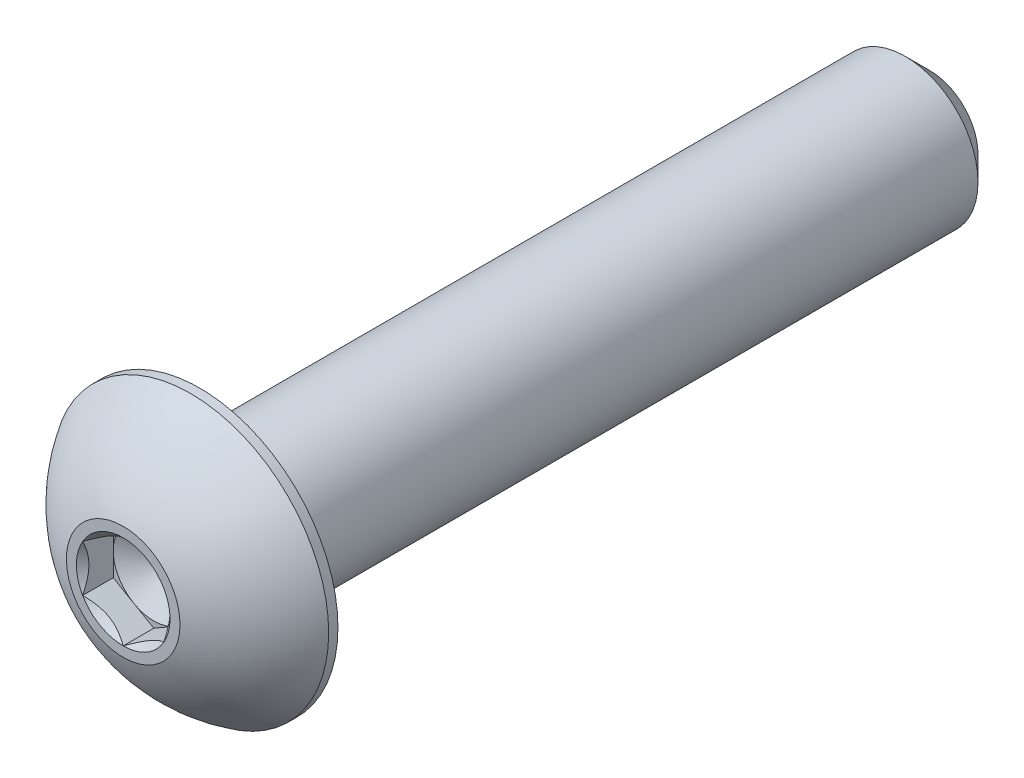
ISO-10303-21;
HEADER;
FILE_DESCRIPTION(('STEP AP214'),'2;1');
FILE_NAME('part.step','',(''),(''),'','','');
FILE_SCHEMA(('AUTOMOTIVE_DESIGN { 1 0 10303 214 1 1 1 1 }'));
ENDSEC;
DATA;
#1=APPLICATION_CONTEXT('core data for automotive mechanical design processes');
#2=APPLICATION_PROTOCOL_DEFINITION('international standard','automotive_design',2000,#1);
#3=PRODUCT_CONTEXT('',#1,'mechanical');
#4=PRODUCT('Part','Part','',(#3));
#5=PRODUCT_RELATED_PRODUCT_CATEGORY('part','',(#4));
#6=PRODUCT_DEFINITION_FORMATION('','',#4);
#7=PRODUCT_DEFINITION_CONTEXT('part definition',#1,'design');
#8=PRODUCT_DEFINITION('design','',#6,#7);
#9=PRODUCT_DEFINITION_SHAPE('','',#8);
#10=(LENGTH_UNIT() NAMED_UNIT(*) SI_UNIT(.MILLI.,.METRE.));
#11=(NAMED_UNIT(*) PLANE_ANGLE_UNIT() SI_UNIT($,.RADIAN.));
#12=(NAMED_UNIT(*) SI_UNIT($,.STERADIAN.) SOLID_ANGLE_UNIT());
#13=UNCERTAINTY_MEASURE_WITH_UNIT(LENGTH_MEASURE(1.E-05),#10,'distance_accuracy_value','');
#14=(GEOMETRIC_REPRESENTATION_CONTEXT(3) GLOBAL_UNCERTAINTY_ASSIGNED_CONTEXT((#13)) GLOBAL_UNIT_ASSIGNED_CONTEXT((#10,
#11,#12)) REPRESENTATION_CONTEXT('',''));
#15=CARTESIAN_POINT('',(0.,0.,0.));
#16=DIRECTION('',(0.,0.,1.));
#17=DIRECTION('',(1.,0.,0.));
#18=AXIS2_PLACEMENT_3D('',#15,#16,#17);
#19=CARTESIAN_POINT('',(0.,0.,7.89305));
#20=DIRECTION('',(0.,0.,1.));
#21=DIRECTION('',(1.,0.,0.));
#22=AXIS2_PLACEMENT_3D('',#19,#20,#21);
#23=CYLINDRICAL_SURFACE('',#22,1.4224);
#24=CARTESIAN_POINT('',(0.,0.,-7.4168));
#25=DIRECTION('',(0.,0.,1.));
#26=DIRECTION('',(1.,0.,0.));
#27=AXIS2_PLACEMENT_3D('',#24,#25,#26);
#28=CIRCLE('',#27,1.4224);
#29=CARTESIAN_POINT('',(1.4224,0.,-7.4168));
#30=VERTEX_POINT('',#29);
#31=EDGE_CURVE('E48',#30,#30,#28,.T.);
#32=ORIENTED_EDGE('',*,*,#31,.T.);
#33=EDGE_LOOP('',(#32));
#34=FACE_BOUND('',#33,.T.);
#35=CARTESIAN_POINT('',(0.,0.,6.38213165465657));
#36=DIRECTION('',(0.,0.,1.));
#37=DIRECTION('',(1.,0.,0.));
#38=AXIS2_PLACEMENT_3D('',#35,#36,#37);
#39=CIRCLE('',#38,1.4224);
#40=CARTESIAN_POINT('',(1.4224,0.,6.38213165465657));
#41=VERTEX_POINT('',#40);
#42=EDGE_CURVE('E12',#41,#41,#39,.T.);
#43=ORIENTED_EDGE('',*,*,#42,.F.);
#44=EDGE_LOOP('',(#43));
#45=FACE_BOUND('',#44,.T.);
#46=ADVANCED_FACE('F40',(#34,#45),#23,.T.);
#47=CARTESIAN_POINT('',(0.,0.,-7.89305));
#48=DIRECTION('',(0.,0.,1.));
#49=DIRECTION('',(1.,0.,0.));
#50=AXIS2_PLACEMENT_3D('',#47,#48,#49);
#51=CONICAL_SURFACE('',#50,0.946150000000002,0.785398163397447);
#52=ORIENTED_EDGE('',*,*,#31,.F.);
#53=EDGE_LOOP('',(#52));
#54=FACE_BOUND('',#53,.T.);
#55=CARTESIAN_POINT('',(0.,0.,-7.89305));
#56=DIRECTION('',(0.,0.,1.));
#57=DIRECTION('',(1.,0.,0.));
#58=AXIS2_PLACEMENT_3D('',#55,#56,#57);
#59=CIRCLE('',#58,0.946150000000002);
#60=CARTESIAN_POINT('',(0.946150000000002,0.,-7.89305));
#61=VERTEX_POINT('',#60);
#62=EDGE_CURVE('E263',#61,#61,#59,.T.);
#63=ORIENTED_EDGE('',*,*,#62,.T.);
#64=EDGE_LOOP('',(#63));
#65=FACE_BOUND('',#64,.T.);
#66=ADVANCED_FACE('F42',(#54,#65),#51,.T.);
#67=CARTESIAN_POINT('',(0.,0.946150000000002,-7.89305));
#68=DIRECTION('',(0.,0.,1.));
#69=DIRECTION('',(1.,0.,0.));
#70=AXIS2_PLACEMENT_3D('',#67,#68,#69);
#71=PLANE('',#70);
#72=ORIENTED_EDGE('',*,*,#62,.F.);
#73=EDGE_LOOP('',(#72));
#74=FACE_BOUND('',#73,.T.);
#75=ADVANCED_FACE('F272',(#74),#71,.F.);
#76=CARTESIAN_POINT('',(0.,0.,6.39445));
#77=DIRECTION('',(0.,0.,1.));
#78=DIRECTION('',(-1.,0.,0.));
#79=AXIS2_PLACEMENT_3D('',#76,#77,#78);
#80=CONICAL_SURFACE('',#79,1.429512,0.5235987755983);
#81=CARTESIAN_POINT('',(0.,0.,6.39445));
#82=DIRECTION('',(0.,0.,-1.));
#83=DIRECTION('',(-1.,0.,0.));
#84=AXIS2_PLACEMENT_3D('',#81,#82,#83);
#85=CIRCLE('',#84,1.429512);
#86=CARTESIAN_POINT('',(-1.429512,0.,6.39445));
#87=VERTEX_POINT('',#86);
#88=EDGE_CURVE('E260',#87,#87,#85,.T.);
#89=ORIENTED_EDGE('',*,*,#88,.T.);
#90=EDGE_LOOP('',(#89));
#91=FACE_BOUND('',#90,.T.);
#92=ORIENTED_EDGE('',*,*,#42,.T.);
#93=EDGE_LOOP('',(#92));
#94=FACE_BOUND('',#93,.T.);
#95=ADVANCED_FACE('F273',(#91,#94),#80,.T.);
#96=CARTESIAN_POINT('',(2.7051,0.,6.39445));
#97=DIRECTION('',(0.,0.,-1.));
#98=DIRECTION('',(-1.,0.,0.));
#99=AXIS2_PLACEMENT_3D('',#96,#97,#98);
#100=PLANE('',#99);
#101=ORIENTED_EDGE('',*,*,#88,.F.);
#102=EDGE_LOOP('',(#101));
#103=FACE_BOUND('',#102,.T.);
#104=CARTESIAN_POINT('',(0.,0.,6.39445));
#105=DIRECTION('',(0.,0.,1.));
#106=DIRECTION('',(1.,0.,0.));
#107=AXIS2_PLACEMENT_3D('',#104,#105,#106);
#108=CIRCLE('',#107,2.7051);
#109=CARTESIAN_POINT('',(2.7051,0.,6.39445));
#110=VERTEX_POINT('',#109);
#111=EDGE_CURVE('E449',#110,#110,#108,.T.);
#112=ORIENTED_EDGE('',*,*,#111,.F.);
#113=EDGE_LOOP('',(#112));
#114=FACE_BOUND('',#113,.T.);
#115=ADVANCED_FACE('F283',(#103,#114),#100,.T.);
#116=CARTESIAN_POINT('',(0.,0.,7.29361));
#117=DIRECTION('',(0.,0.,1.));
#118=DIRECTION('',(1.,0.,0.));
#119=AXIS2_PLACEMENT_3D('',#116,#117,#118);
#120=CONICAL_SURFACE('',#119,0.79375,1.0471975511966);
#121=CARTESIAN_POINT('',(0.,0.,6.83533822383074));
#122=VERTEX_POINT('',#121);
#123=VERTEX_LOOP('',#122);
#124=FACE_BOUND('',#123,.T.);
#125=CARTESIAN_POINT('',(0.,0.,7.29361));
#126=DIRECTION('',(0.,0.,1.));
#127=DIRECTION('',(1.,0.,0.));
#128=AXIS2_PLACEMENT_3D('',#125,#126,#127);
#129=CIRCLE('',#128,0.79375);
#130=CARTESIAN_POINT('',(0.79375,0.,7.29361));
#131=VERTEX_POINT('',#130);
#132=CARTESIAN_POINT('',(0.396874999999999,0.687407664253898,7.29361));
#133=VERTEX_POINT('',#132);
#134=EDGE_CURVE('E118',#131,#133,#129,.T.);
#135=ORIENTED_EDGE('',*,*,#134,.T.);
#136=CARTESIAN_POINT('',(-0.396875,0.687407664253898,7.29361));
#137=VERTEX_POINT('',#136);
#138=EDGE_CURVE('E137',#133,#137,#129,.T.);
#139=ORIENTED_EDGE('',*,*,#138,.T.);
#140=CARTESIAN_POINT('',(-0.79375,0.,7.29361));
#141=VERTEX_POINT('',#140);
#142=EDGE_CURVE('E142',#137,#141,#129,.T.);
#143=ORIENTED_EDGE('',*,*,#142,.T.);
#144=CARTESIAN_POINT('',(-0.396875,-0.687407664253899,7.29361));
#145=VERTEX_POINT('',#144);
#146=EDGE_CURVE('E155',#141,#145,#129,.T.);
#147=ORIENTED_EDGE('',*,*,#146,.T.);
#148=CARTESIAN_POINT('',(0.396875,-0.687407664253898,7.29361));
#149=VERTEX_POINT('',#148);
#150=EDGE_CURVE('E153',#145,#149,#129,.T.);
#151=ORIENTED_EDGE('',*,*,#150,.T.);
#152=EDGE_CURVE('E147',#149,#131,#129,.T.);
#153=ORIENTED_EDGE('',*,*,#152,.T.);
#154=EDGE_LOOP('',(#135,#139,#143,#147,#151,#153));
#155=FACE_BOUND('',#154,.T.);
#156=ADVANCED_FACE('F145',(#124,#155),#120,.F.);
#157=CARTESIAN_POINT('',(0.,0.,7.29361));
#158=DIRECTION('',(0.,0.,1.));
#159=DIRECTION('',(1.,0.,0.));
#160=AXIS2_PLACEMENT_3D('',#157,#158,#159);
#161=PLANE('',#160);
#162=ORIENTED_EDGE('',*,*,#146,.F.);
#163=DIRECTION('',(0.,-1.,0.));
#164=VECTOR('',#163,1.);
#165=CARTESIAN_POINT('',(-0.79375,0.458271776169265,7.29361));
#166=LINE('',#165,#164);
#167=CARTESIAN_POINT('',(-0.79375,-0.458271776169266,7.29361));
#168=VERTEX_POINT('',#167);
#169=EDGE_CURVE('E169',#141,#168,#166,.T.);
#170=ORIENTED_EDGE('',*,*,#169,.T.);
#171=DIRECTION('',(0.866025403784439,-0.499999999999999,0.));
#172=VECTOR('',#171,1.);
#173=CARTESIAN_POINT('',(-0.79375,-0.458271776169266,7.29361));
#174=LINE('',#173,#172);
#175=EDGE_CURVE('E482',#168,#145,#174,.T.);
#176=ORIENTED_EDGE('',*,*,#175,.T.);
#177=EDGE_LOOP('',(#162,#170,#176));
#178=FACE_BOUND('',#177,.T.);
#179=ADVANCED_FACE('F310',(#178),#161,.T.);
#180=ORIENTED_EDGE('',*,*,#150,.F.);
#181=CARTESIAN_POINT('',(0.,-0.916543552338531,7.29361));
#182=VERTEX_POINT('',#181);
#183=EDGE_CURVE('E484',#145,#182,#174,.T.);
#184=ORIENTED_EDGE('',*,*,#183,.T.);
#185=DIRECTION('',(0.866025403784438,0.5,0.));
#186=VECTOR('',#185,1.);
#187=CARTESIAN_POINT('',(0.,-0.916543552338531,7.29361));
#188=LINE('',#187,#186);
#189=EDGE_CURVE('E479',#182,#149,#188,.T.);
#190=ORIENTED_EDGE('',*,*,#189,.T.);
#191=EDGE_LOOP('',(#180,#184,#190));
#192=FACE_BOUND('',#191,.T.);
#193=ADVANCED_FACE('F318',(#192),#161,.T.);
#194=ORIENTED_EDGE('',*,*,#152,.F.);
#195=CARTESIAN_POINT('',(0.79375,-0.458271776169265,7.29361));
#196=VERTEX_POINT('',#195);
#197=EDGE_CURVE('E481',#149,#196,#188,.T.);
#198=ORIENTED_EDGE('',*,*,#197,.T.);
#199=DIRECTION('',(0.,1.,0.));
#200=VECTOR('',#199,1.);
#201=CARTESIAN_POINT('',(0.79375,-0.458271776169265,7.29361));
#202=LINE('',#201,#200);
#203=EDGE_CURVE('E476',#196,#131,#202,.T.);
#204=ORIENTED_EDGE('',*,*,#203,.T.);
#205=EDGE_LOOP('',(#194,#198,#204));
#206=FACE_BOUND('',#205,.T.);
#207=ADVANCED_FACE('F325',(#206),#161,.T.);
#208=ORIENTED_EDGE('',*,*,#134,.F.);
#209=CARTESIAN_POINT('',(0.79375,0.458271776169266,7.29361));
#210=VERTEX_POINT('',#209);
#211=EDGE_CURVE('E120',#131,#210,#202,.T.);
#212=ORIENTED_EDGE('',*,*,#211,.T.);
#213=DIRECTION('',(-0.866025403784439,0.499999999999999,0.));
#214=VECTOR('',#213,1.);
#215=CARTESIAN_POINT('',(0.79375,0.458271776169266,7.29361));
#216=LINE('',#215,#214);
#217=EDGE_CURVE('E114',#210,#133,#216,.T.);
#218=ORIENTED_EDGE('',*,*,#217,.T.);
#219=EDGE_LOOP('',(#208,#212,#218));
#220=FACE_BOUND('',#219,.T.);
#221=ADVANCED_FACE('F116',(#220),#161,.T.);
#222=ORIENTED_EDGE('',*,*,#138,.F.);
#223=CARTESIAN_POINT('',(0.,0.916543552338531,7.29361));
#224=VERTEX_POINT('',#223);
#225=EDGE_CURVE('E124',#133,#224,#216,.T.);
#226=ORIENTED_EDGE('',*,*,#225,.T.);
#227=DIRECTION('',(-0.866025403784438,-0.5,0.));
#228=VECTOR('',#227,1.);
#229=CARTESIAN_POINT('',(0.,0.916543552338531,7.29361));
#230=LINE('',#229,#228);
#231=EDGE_CURVE('E139',#224,#137,#230,.T.);
#232=ORIENTED_EDGE('',*,*,#231,.T.);
#233=EDGE_LOOP('',(#222,#226,#232));
#234=FACE_BOUND('',#233,.T.);
#235=ADVANCED_FACE('F138',(#234),#161,.T.);
#236=ORIENTED_EDGE('',*,*,#142,.F.);
#237=CARTESIAN_POINT('',(-0.79375,0.458271776169265,7.29361));
#238=VERTEX_POINT('',#237);
#239=EDGE_CURVE('E125',#137,#238,#230,.T.);
#240=ORIENTED_EDGE('',*,*,#239,.T.);
#241=EDGE_CURVE('E163',#238,#141,#166,.T.);
#242=ORIENTED_EDGE('',*,*,#241,.T.);
#243=EDGE_LOOP('',(#236,#240,#242));
#244=FACE_BOUND('',#243,.T.);
#245=ADVANCED_FACE('F160',(#244),#161,.T.);
#246=CARTESIAN_POINT('',(-0.79375,0.458271776169265,7.89305));
#247=DIRECTION('',(1.,0.,0.));
#248=DIRECTION('',(0.,1.,0.));
#249=AXIS2_PLACEMENT_3D('',#246,#247,#248);
#250=PLANE('',#249);
#251=CARTESIAN_POINT('',(-0.79375,-0.886414096599245,8.16636736942916));
#252=CARTESIAN_POINT('',(-0.79375,-0.864701714199921,8.15019470678827));
#253=CARTESIAN_POINT('',(-0.79375,-0.84286538806372,8.13418885240305));
#254=CARTESIAN_POINT('',(-0.79375,-0.798895674093471,8.10257876580154));
#255=CARTESIAN_POINT('',(-0.79375,-0.776762210654222,8.08697463886703));
#256=CARTESIAN_POINT('',(-0.79375,-0.709518845973246,8.04064483271595));
#257=CARTESIAN_POINT('',(-0.79375,-0.663896155634681,8.01065094914757));
#258=CARTESIAN_POINT('',(-0.79375,-0.568400086548214,7.95201512389417));
#259=CARTESIAN_POINT('',(-0.79375,-0.518429613643663,7.92352938225233));
#260=CARTESIAN_POINT('',(-0.79375,-0.416032101977318,7.87159504880167));
#261=CARTESIAN_POINT('',(-0.79375,-0.363614070820857,7.84812952562059));
#262=CARTESIAN_POINT('',(-0.79375,-0.284656617559875,7.81943367250404));
#263=CARTESIAN_POINT('',(-0.79375,-0.259232429165401,7.81115416001904));
#264=CARTESIAN_POINT('',(-0.79375,-0.20780736405375,7.7966343748874));
#265=CARTESIAN_POINT('',(-0.79375,-0.181806445486241,7.79039425074902));
#266=CARTESIAN_POINT('',(-0.79375,-0.104000822329059,7.77545941347527));
#267=CARTESIAN_POINT('',(-0.79375,-0.0514629352178528,7.77018917525149));
#268=CARTESIAN_POINT('',(-0.79375,0.0519230063012075,7.77032298750896));
#269=CARTESIAN_POINT('',(-0.79375,0.102771763174831,7.77539351587352));
#270=CARTESIAN_POINT('',(-0.79375,0.178135386060791,7.78960873388841));
#271=CARTESIAN_POINT('',(-0.79375,0.203324278837549,7.79553165958048));
#272=CARTESIAN_POINT('',(-0.79375,0.253165828732922,7.80931036344039));
#273=CARTESIAN_POINT('',(-0.79375,0.277818539396017,7.81716594763457));
#274=CARTESIAN_POINT('',(-0.79375,0.35674586112401,7.84523863718015));
#275=CARTESIAN_POINT('',(-0.79375,0.409857837794495,7.8687080422539));
#276=CARTESIAN_POINT('',(-0.79375,0.513576140604893,7.92084685067415));
#277=CARTESIAN_POINT('',(-0.79375,0.564172447910595,7.94953520882156));
#278=CARTESIAN_POINT('',(-0.79375,0.660846745738731,8.0086768692853));
#279=CARTESIAN_POINT('',(-0.79375,0.707024109054006,8.03896975969033));
#280=CARTESIAN_POINT('',(-0.79375,0.775058121051353,8.08578034954389));
#281=CARTESIAN_POINT('',(-0.79375,0.797441820874693,8.10154526319896));
#282=CARTESIAN_POINT('',(-0.79375,0.841904444862717,8.13348700714118));
#283=CARTESIAN_POINT('',(-0.79375,0.863983450465095,8.14966372394076));
#284=CARTESIAN_POINT('',(-0.79375,0.885935743338024,8.16601105203418));
#285=B_SPLINE_CURVE_WITH_KNOTS('',3,(#251,#252,#253,#254,#255,#256,#257,#258,#259,#260,#261,
#262,#263,#264,#265,#266,#267,#268,#269,#270,#271,#272,#273,#274,#275,#276,#277,#278,#279,#280,
#281,#282,#283,#284),.UNSPECIFIED.,.F.,.F.,(4,2,2,2,2,2,2,2,2,2,2,2,2,2,2,2,4),(0.,
0.0812188387950309,0.162458750511487,0.326178806253455,0.498586653888077,0.67040353143817,
0.750543907216537,0.830690117517372,0.988028410529606,1.14037233605713,1.21793318643015,
1.29548625548648,1.46917505876894,1.64350775825017,1.80910713566104,1.8912384673972,
1.97334740474277),.UNSPECIFIED.);
#286=CARTESIAN_POINT('',(-0.79375,0.458271776169265,7.89305));
#287=VERTEX_POINT('',#286);
#288=CARTESIAN_POINT('',(-0.79375,-0.458271776169266,7.89305));
#289=VERTEX_POINT('',#288);
#290=EDGE_CURVE('E183',#287,#289,#285,.F.);
#291=ORIENTED_EDGE('',*,*,#290,.T.);
#292=DIRECTION('',(0.,0.,-1.));
#293=VECTOR('',#292,1.);
#294=CARTESIAN_POINT('',(-0.79375,-0.458271776169266,7.89305));
#295=LINE('',#294,#293);
#296=EDGE_CURVE('E464',#289,#168,#295,.T.);
#297=ORIENTED_EDGE('',*,*,#296,.T.);
#298=ORIENTED_EDGE('',*,*,#169,.F.);
#299=ORIENTED_EDGE('',*,*,#241,.F.);
#300=DIRECTION('',(0.,0.,-1.));
#301=VECTOR('',#300,1.);
#302=CARTESIAN_POINT('',(-0.79375,0.458271776169265,7.89305));
#303=LINE('',#302,#301);
#304=EDGE_CURVE('E154',#287,#238,#303,.T.);
#305=ORIENTED_EDGE('',*,*,#304,.F.);
#306=EDGE_LOOP('',(#291,#297,#298,#299,#305));
#307=FACE_BOUND('',#306,.T.);
#308=ADVANCED_FACE('F348',(#307),#250,.T.);
#309=CARTESIAN_POINT('',(-0.79375,-0.458271776169266,7.89305));
#310=DIRECTION('',(0.5,0.866025403784439,0.));
#311=DIRECTION('',(-0.866025403784439,0.5,0.));
#312=AXIS2_PLACEMENT_3D('',#309,#310,#311);
#313=PLANE('',#312);
#314=CARTESIAN_POINT('',(-0.79395,-0.458156306115428,7.8931654918722));
#315=CARTESIAN_POINT('',(-0.7666563268291,-0.473914315667821,7.87741677881996));
#316=CARTESIAN_POINT('',(-0.738906237701708,-0.489935837095556,7.86259254758418));
#317=CARTESIAN_POINT('',(-0.682320250463159,-0.522605772060093,7.83544903778593));
#318=CARTESIAN_POINT('',(-0.653478963353311,-0.53925729693674,7.82314487372838));
#319=CARTESIAN_POINT('',(-0.595321679020444,-0.572834420701658,7.80206736657059));
#320=CARTESIAN_POINT('',(-0.566020514797219,-0.589751455753506,7.79324100814755));
#321=CARTESIAN_POINT('',(-0.506773157113023,-0.623957933661251,7.77964123872424));
#322=CARTESIAN_POINT('',(-0.476828775638362,-0.641246330366363,7.77485766812998));
#323=CARTESIAN_POINT('',(-0.425225377533547,-0.671039566153277,7.77054340945594));
#324=CARTESIAN_POINT('',(-0.403633531741488,-0.683505624133624,7.76990527141097));
#325=CARTESIAN_POINT('',(-0.360491632722968,-0.708413611145318,7.77097613979119));
#326=CARTESIAN_POINT('',(-0.338941589763514,-0.720855534249006,7.77268566388179));
#327=CARTESIAN_POINT('',(-0.274599154455216,-0.758003656594568,7.78122279115859));
#328=CARTESIAN_POINT('',(-0.232126946019304,-0.78252499756812,7.79145991913679));
#329=CARTESIAN_POINT('',(-0.157575609219718,-0.825567231937807,7.81616858984055));
#330=CARTESIAN_POINT('',(-0.125147212182332,-0.84428977569673,7.82934617467531));
#331=CARTESIAN_POINT('',(-0.061560853538516,-0.881001376976525,7.85903103995168));
#332=CARTESIAN_POINT('',(-0.0303991453684825,-0.898992597576903,7.87552748789317));
#333=CARTESIAN_POINT('',(0.000200000000000726,-0.916659022392369,7.8931654918722));
#334=B_SPLINE_CURVE_WITH_KNOTS('',3,(#314,#315,#316,#317,#318,#319,#320,#321,#322,#323,#324,
#325,#326,#327,#328,#329,#330,#331,#332,#333),.UNSPECIFIED.,.F.,.F.,(4,2,2,2,2,2,2,2,2,4),(0.,
0.105768699105622,0.212154297186221,0.316848842533859,0.421279499712346,0.495991864977074,
0.570720707151284,0.720221070373884,0.839150369964801,0.957697614118391),.UNSPECIFIED.);
#335=CARTESIAN_POINT('',(0.,-0.916543552338531,7.89305));
#336=VERTEX_POINT('',#335);
#337=EDGE_CURVE('E209',#289,#336,#334,.T.);
#338=ORIENTED_EDGE('',*,*,#337,.T.);
#339=DIRECTION('',(0.,0.,-1.));
#340=VECTOR('',#339,1.);
#341=CARTESIAN_POINT('',(0.,-0.916543552338531,7.89305));
#342=LINE('',#341,#340);
#343=EDGE_CURVE('E466',#336,#182,#342,.T.);
#344=ORIENTED_EDGE('',*,*,#343,.T.);
#345=ORIENTED_EDGE('',*,*,#183,.F.);
#346=ORIENTED_EDGE('',*,*,#175,.F.);
#347=ORIENTED_EDGE('',*,*,#296,.F.);
#348=EDGE_LOOP('',(#338,#344,#345,#346,#347));
#349=FACE_BOUND('',#348,.T.);
#350=ADVANCED_FACE('F354',(#349),#313,.T.);
#351=CARTESIAN_POINT('',(0.,-0.916543552338531,7.89305));
#352=DIRECTION('',(-0.5,0.866025403784438,0.));
#353=DIRECTION('',(-0.866025403784439,-0.5,0.));
#354=AXIS2_PLACEMENT_3D('',#351,#352,#353);
#355=PLANE('',#354);
#356=CARTESIAN_POINT('',(-0.000199999999999346,-0.916659022392369,7.8931654918722));
#357=CARTESIAN_POINT('',(0.0270936731709004,-0.900901012839976,7.87741677881996));
#358=CARTESIAN_POINT('',(0.0548437622982917,-0.884879491412241,7.86259254758418));
#359=CARTESIAN_POINT('',(0.11142974953684,-0.852209556447704,7.83544903778593));
#360=CARTESIAN_POINT('',(0.140271036646689,-0.835558031571058,7.82314487372838));
#361=CARTESIAN_POINT('',(0.198428320979555,-0.80198090780614,7.80206736657059));
#362=CARTESIAN_POINT('',(0.22772948520278,-0.785063872754291,7.79324100814755));
#363=CARTESIAN_POINT('',(0.286976842886977,-0.750857394846546,7.77964123872424));
#364=CARTESIAN_POINT('',(0.316921224361638,-0.733568998141434,7.77485766812998));
#365=CARTESIAN_POINT('',(0.368524622466452,-0.70377576235452,7.77054340945595));
#366=CARTESIAN_POINT('',(0.390116468258512,-0.691309704374173,7.76990527141097));
#367=CARTESIAN_POINT('',(0.433258367277032,-0.666401717362479,7.77097613979119));
#368=CARTESIAN_POINT('',(0.454808410236485,-0.653959794258791,7.77268566388179));
#369=CARTESIAN_POINT('',(0.519150845544783,-0.616811671913229,7.78122279115859));
#370=CARTESIAN_POINT('',(0.561623053980695,-0.592290330939677,7.79145991913679));
#371=CARTESIAN_POINT('',(0.636174390780281,-0.549248096569989,7.81616858984055));
#372=CARTESIAN_POINT('',(0.668602787817667,-0.530525552811067,7.82934617467531));
#373=CARTESIAN_POINT('',(0.732189146461483,-0.493813951531271,7.85903103995168));
#374=CARTESIAN_POINT('',(0.763350854631517,-0.475822730930894,7.87552748789317));
#375=CARTESIAN_POINT('',(0.79395,-0.458156306115427,7.8931654918722));
#376=B_SPLINE_CURVE_WITH_KNOTS('',3,(#356,#357,#358,#359,#360,#361,#362,#363,#364,#365,#366,
#367,#368,#369,#370,#371,#372,#373,#374,#375),.UNSPECIFIED.,.F.,.F.,(4,2,2,2,2,2,2,2,2,4),(0.,
0.105768699105622,0.21215429718622,0.316848842533858,0.421279499712345,0.495991864977073,
0.570720707151282,0.720221070373883,0.8391503699648,0.957697614118391),.UNSPECIFIED.);
#377=CARTESIAN_POINT('',(0.79375,-0.458271776169265,7.89305));
#378=VERTEX_POINT('',#377);
#379=EDGE_CURVE('E208',#336,#378,#376,.T.);
#380=ORIENTED_EDGE('',*,*,#379,.T.);
#381=DIRECTION('',(0.,0.,-1.));
#382=VECTOR('',#381,1.);
#383=CARTESIAN_POINT('',(0.79375,-0.458271776169265,7.89305));
#384=LINE('',#383,#382);
#385=EDGE_CURVE('E471',#378,#196,#384,.T.);
#386=ORIENTED_EDGE('',*,*,#385,.T.);
#387=ORIENTED_EDGE('',*,*,#197,.F.);
#388=ORIENTED_EDGE('',*,*,#189,.F.);
#389=ORIENTED_EDGE('',*,*,#343,.F.);
#390=EDGE_LOOP('',(#380,#386,#387,#388,#389));
#391=FACE_BOUND('',#390,.T.);
#392=ADVANCED_FACE('F362',(#391),#355,.T.);
#393=CARTESIAN_POINT('',(0.79375,-0.458271776169265,7.89305));
#394=DIRECTION('',(-1.,0.,0.));
#395=DIRECTION('',(0.,-1.,0.));
#396=AXIS2_PLACEMENT_3D('',#393,#394,#395);
#397=PLANE('',#396);
#398=CARTESIAN_POINT('',(0.793750000000001,-0.886414096599243,8.16636736942915));
#399=CARTESIAN_POINT('',(0.793750000000001,-0.864701714199919,8.15019470678827));
#400=CARTESIAN_POINT('',(0.793750000000001,-0.842865388063718,8.13418885240305));
#401=CARTESIAN_POINT('',(0.793750000000001,-0.798895674093469,8.10257876580154));
#402=CARTESIAN_POINT('',(0.793750000000001,-0.77676221065422,8.08697463886703));
#403=CARTESIAN_POINT('',(0.793750000000001,-0.709518845973244,8.04064483271595));
#404=CARTESIAN_POINT('',(0.793750000000001,-0.663896155634679,8.01065094914757));
#405=CARTESIAN_POINT('',(0.793750000000001,-0.568400086548212,7.95201512389417));
#406=CARTESIAN_POINT('',(0.79375,-0.518429613643661,7.92352938225233));
#407=CARTESIAN_POINT('',(0.79375,-0.416032101977316,7.87159504880167));
#408=CARTESIAN_POINT('',(0.793750000000001,-0.363614070820856,7.84812952562059));
#409=CARTESIAN_POINT('',(0.79375,-0.284656617559875,7.81943367250404));
#410=CARTESIAN_POINT('',(0.79375,-0.2592324291654,7.81115416001904));
#411=CARTESIAN_POINT('',(0.79375,-0.207807364053749,7.7966343748874));
#412=CARTESIAN_POINT('',(0.79375,-0.181806445486239,7.79039425074902));
#413=CARTESIAN_POINT('',(0.79375,-0.104000822329057,7.77545941347527));
#414=CARTESIAN_POINT('',(0.79375,-0.0514629352178513,7.77018917525149));
#415=CARTESIAN_POINT('',(0.79375,0.0519230063012089,7.77032298750897));
#416=CARTESIAN_POINT('',(0.79375,0.102771763174832,7.77539351587352));
#417=CARTESIAN_POINT('',(0.79375,0.178135386060792,7.78960873388841));
#418=CARTESIAN_POINT('',(0.79375,0.20332427883755,7.79553165958048));
#419=CARTESIAN_POINT('',(0.79375,0.253165828732923,7.80931036344039));
#420=CARTESIAN_POINT('',(0.79375,0.277818539396019,7.81716594763457));
#421=CARTESIAN_POINT('',(0.79375,0.356745861124012,7.84523863718015));
#422=CARTESIAN_POINT('',(0.79375,0.409857837794496,7.8687080422539));
#423=CARTESIAN_POINT('',(0.79375,0.513576140604893,7.92084685067416));
#424=CARTESIAN_POINT('',(0.79375,0.564172447910596,7.94953520882156));
#425=CARTESIAN_POINT('',(0.79375,0.660846745738732,8.0086768692853));
#426=CARTESIAN_POINT('',(0.79375,0.707024109054008,8.03896975969033));
#427=CARTESIAN_POINT('',(0.79375,0.775058121051355,8.08578034954389));
#428=CARTESIAN_POINT('',(0.79375,0.797441820874696,8.10154526319896));
#429=CARTESIAN_POINT('',(0.79375,0.84190444486272,8.13348700714118));
#430=CARTESIAN_POINT('',(0.79375,0.863983450465098,8.14966372394076));
#431=CARTESIAN_POINT('',(0.79375,0.885935743338027,8.16601105203419));
#432=B_SPLINE_CURVE_WITH_KNOTS('',3,(#398,#399,#400,#401,#402,#403,#404,#405,#406,#407,#408,
#409,#410,#411,#412,#413,#414,#415,#416,#417,#418,#419,#420,#421,#422,#423,#424,#425,#426,#427,
#428,#429,#430,#431),.UNSPECIFIED.,.F.,.F.,(4,2,2,2,2,2,2,2,2,2,2,2,2,2,2,2,4),(0.,
0.0812188387950316,0.162458750511488,0.326178806253455,0.498586653888077,0.670403531438168,
0.750543907216536,0.830690117517371,0.988028410529605,1.14037233605713,1.21793318643015,
1.29548625548648,1.46917505876894,1.64350775825017,1.80910713566104,1.8912384673972,
1.97334740474278),.UNSPECIFIED.);
#433=CARTESIAN_POINT('',(0.79375,0.458271776169265,7.89305));
#434=VERTEX_POINT('',#433);
#435=EDGE_CURVE('E61',#378,#434,#432,.T.);
#436=ORIENTED_EDGE('',*,*,#435,.T.);
#437=DIRECTION('',(0.,0.,-1.));
#438=VECTOR('',#437,1.);
#439=CARTESIAN_POINT('',(0.79375,0.458271776169266,7.89305));
#440=LINE('',#439,#438);
#441=EDGE_CURVE('E474',#434,#210,#440,.T.);
#442=ORIENTED_EDGE('',*,*,#441,.T.);
#443=ORIENTED_EDGE('',*,*,#211,.F.);
#444=ORIENTED_EDGE('',*,*,#203,.F.);
#445=ORIENTED_EDGE('',*,*,#385,.F.);
#446=EDGE_LOOP('',(#436,#442,#443,#444,#445));
#447=FACE_BOUND('',#446,.T.);
#448=ADVANCED_FACE('F370',(#447),#397,.T.);
#449=CARTESIAN_POINT('',(0.79375,0.458271776169266,7.89305));
#450=DIRECTION('',(-0.499999999999999,-0.866025403784439,0.));
#451=DIRECTION('',(0.866025403784439,-0.499999999999999,0.));
#452=AXIS2_PLACEMENT_3D('',#449,#450,#451);
#453=PLANE('',#452);
#454=CARTESIAN_POINT('',(0.79395,0.458156306115428,7.8931654918722));
#455=CARTESIAN_POINT('',(0.7666563268291,0.473914315667821,7.87741677881996));
#456=CARTESIAN_POINT('',(0.738906237701708,0.489935837095556,7.86259254758418));
#457=CARTESIAN_POINT('',(0.682320250463159,0.522605772060093,7.83544903778593));
#458=CARTESIAN_POINT('',(0.653478963353311,0.53925729693674,7.82314487372838));
#459=CARTESIAN_POINT('',(0.595321679020444,0.572834420701658,7.80206736657059));
#460=CARTESIAN_POINT('',(0.566020514797219,0.589751455753506,7.79324100814755));
#461=CARTESIAN_POINT('',(0.506773157113023,0.623957933661251,7.77964123872424));
#462=CARTESIAN_POINT('',(0.476828775638362,0.641246330366363,7.77485766812998));
#463=CARTESIAN_POINT('',(0.425225377533547,0.671039566153277,7.77054340945594));
#464=CARTESIAN_POINT('',(0.403633531741488,0.683505624133624,7.76990527141097));
#465=CARTESIAN_POINT('',(0.360491632722968,0.708413611145318,7.77097613979119));
#466=CARTESIAN_POINT('',(0.338941589763514,0.720855534249006,7.77268566388179));
#467=CARTESIAN_POINT('',(0.274599154455216,0.758003656594568,7.78122279115859));
#468=CARTESIAN_POINT('',(0.232126946019304,0.78252499756812,7.79145991913679));
#469=CARTESIAN_POINT('',(0.157575609219718,0.825567231937807,7.81616858984055));
#470=CARTESIAN_POINT('',(0.125147212182332,0.84428977569673,7.82934617467531));
#471=CARTESIAN_POINT('',(0.061560853538516,0.881001376976525,7.85903103995168));
#472=CARTESIAN_POINT('',(0.0303991453684824,0.898992597576903,7.87552748789317));
#473=CARTESIAN_POINT('',(-0.000200000000000894,0.916659022392369,7.8931654918722));
#474=B_SPLINE_CURVE_WITH_KNOTS('',3,(#454,#455,#456,#457,#458,#459,#460,#461,#462,#463,#464,
#465,#466,#467,#468,#469,#470,#471,#472,#473),.UNSPECIFIED.,.F.,.F.,(4,2,2,2,2,2,2,2,2,4),(0.,
0.105768699105622,0.21215429718622,0.316848842533859,0.421279499712346,0.495991864977074,
0.570720707151284,0.720221070373884,0.839150369964801,0.957697614118391),.UNSPECIFIED.);
#475=CARTESIAN_POINT('',(0.,0.916543552338531,7.89305));
#476=VERTEX_POINT('',#475);
#477=EDGE_CURVE('E54',#434,#476,#474,.T.);
#478=ORIENTED_EDGE('',*,*,#477,.T.);
#479=DIRECTION('',(0.,0.,-1.));
#480=VECTOR('',#479,1.);
#481=CARTESIAN_POINT('',(0.,0.916543552338531,7.89305));
#482=LINE('',#481,#480);
#483=EDGE_CURVE('E131',#476,#224,#482,.T.);
#484=ORIENTED_EDGE('',*,*,#483,.T.);
#485=ORIENTED_EDGE('',*,*,#225,.F.);
#486=ORIENTED_EDGE('',*,*,#217,.F.);
#487=ORIENTED_EDGE('',*,*,#441,.F.);
#488=EDGE_LOOP('',(#478,#484,#485,#486,#487));
#489=FACE_BOUND('',#488,.T.);
#490=ADVANCED_FACE('F129',(#489),#453,.T.);
#491=CARTESIAN_POINT('',(0.,0.916543552338531,7.89305));
#492=DIRECTION('',(0.500000000000001,-0.866025403784438,0.));
#493=DIRECTION('',(0.866025403784438,0.500000000000001,0.));
#494=AXIS2_PLACEMENT_3D('',#491,#492,#493);
#495=PLANE('',#494);
#496=CARTESIAN_POINT('',(0.000199999999999503,0.916659022392369,7.8931654918722));
#497=CARTESIAN_POINT('',(-0.0270936731709004,0.900901012839976,7.87741677881996));
#498=CARTESIAN_POINT('',(-0.0548437622982918,0.884879491412241,7.86259254758418));
#499=CARTESIAN_POINT('',(-0.111429749536841,0.852209556447703,7.83544903778593));
#500=CARTESIAN_POINT('',(-0.140271036646689,0.835558031571057,7.82314487372838));
#501=CARTESIAN_POINT('',(-0.198428320979556,0.801980907806139,7.80206736657059));
#502=CARTESIAN_POINT('',(-0.227729485202781,0.785063872754291,7.79324100814755));
#503=CARTESIAN_POINT('',(-0.286976842886977,0.750857394846546,7.77964123872424));
#504=CARTESIAN_POINT('',(-0.316921224361638,0.733568998141433,7.77485766812998));
#505=CARTESIAN_POINT('',(-0.368524622466453,0.703775762354519,7.77054340945594));
#506=CARTESIAN_POINT('',(-0.390116468258512,0.691309704374173,7.76990527141097));
#507=CARTESIAN_POINT('',(-0.433258367277033,0.666401717362478,7.77097613979119));
#508=CARTESIAN_POINT('',(-0.454808410236486,0.65395979425879,7.77268566388179));
#509=CARTESIAN_POINT('',(-0.519150845544784,0.616811671913228,7.78122279115859));
#510=CARTESIAN_POINT('',(-0.561623053980696,0.592290330939676,7.79145991913679));
#511=CARTESIAN_POINT('',(-0.636174390780282,0.549248096569989,7.81616858984055));
#512=CARTESIAN_POINT('',(-0.668602787817668,0.530525552811066,7.82934617467531));
#513=CARTESIAN_POINT('',(-0.732189146461484,0.493813951531271,7.85903103995168));
#514=CARTESIAN_POINT('',(-0.763350854631517,0.475822730930893,7.87552748789317));
#515=CARTESIAN_POINT('',(-0.79395,0.458156306115427,7.8931654918722));
#516=B_SPLINE_CURVE_WITH_KNOTS('',3,(#496,#497,#498,#499,#500,#501,#502,#503,#504,#505,#506,
#507,#508,#509,#510,#511,#512,#513,#514,#515),.UNSPECIFIED.,.F.,.F.,(4,2,2,2,2,2,2,2,2,4),(0.,
0.105768699105622,0.21215429718622,0.316848842533859,0.421279499712346,0.495991864977074,
0.570720707151284,0.720221070373884,0.839150369964801,0.957697614118391),.UNSPECIFIED.);
#517=EDGE_CURVE('E175',#476,#287,#516,.T.);
#518=ORIENTED_EDGE('',*,*,#517,.T.);
#519=ORIENTED_EDGE('',*,*,#304,.T.);
#520=ORIENTED_EDGE('',*,*,#239,.F.);
#521=ORIENTED_EDGE('',*,*,#231,.F.);
#522=ORIENTED_EDGE('',*,*,#483,.F.);
#523=EDGE_LOOP('',(#518,#519,#520,#521,#522));
#524=FACE_BOUND('',#523,.T.);
#525=ADVANCED_FACE('F166',(#524),#495,.T.);
#526=CARTESIAN_POINT('',(0.,0.,7.89305));
#527=DIRECTION('',(0.,0.,1.));
#528=DIRECTION('',(1.,0.,0.));
#529=AXIS2_PLACEMENT_3D('',#526,#527,#528);
#530=CONICAL_SURFACE('',#529,0.916543552338531,0.78539816339745);
#531=CARTESIAN_POINT('',(0.,0.,7.89305));
#532=DIRECTION('',(0.,0.,1.));
#533=DIRECTION('',(1.,0.,0.));
#534=AXIS2_PLACEMENT_3D('',#531,#532,#533);
#535=CIRCLE('',#534,0.916543552338531);
#536=EDGE_CURVE('E184',#287,#289,#535,.T.);
#537=ORIENTED_EDGE('',*,*,#536,.T.);
#538=ORIENTED_EDGE('',*,*,#290,.F.);
#539=EDGE_LOOP('',(#537,#538));
#540=FACE_BOUND('',#539,.T.);
#541=ADVANCED_FACE('F191',(#540),#530,.F.);
#542=CARTESIAN_POINT('',(0.,0.,7.89305));
#543=DIRECTION('',(0.,0.,1.));
#544=DIRECTION('',(1.,0.,0.));
#545=AXIS2_PLACEMENT_3D('',#542,#543,#544);
#546=CONICAL_SURFACE('',#545,0.916543552338531,0.78539816339745);
#547=CARTESIAN_POINT('',(0.,0.,7.89305));
#548=DIRECTION('',(0.,0.,1.));
#549=DIRECTION('',(1.,0.,0.));
#550=AXIS2_PLACEMENT_3D('',#547,#548,#549);
#551=CIRCLE('',#550,0.916543552338531);
#552=EDGE_CURVE('E205',#289,#336,#551,.T.);
#553=ORIENTED_EDGE('',*,*,#552,.T.);
#554=ORIENTED_EDGE('',*,*,#337,.F.);
#555=EDGE_LOOP('',(#553,#554));
#556=FACE_BOUND('',#555,.T.);
#557=ADVANCED_FACE('F195',(#556),#546,.F.);
#558=CARTESIAN_POINT('',(0.,0.,7.89305));
#559=DIRECTION('',(0.,0.,1.));
#560=DIRECTION('',(1.,0.,0.));
#561=AXIS2_PLACEMENT_3D('',#558,#559,#560);
#562=CONICAL_SURFACE('',#561,0.916543552338531,0.78539816339745);
#563=CARTESIAN_POINT('',(0.,0.,7.89305));
#564=DIRECTION('',(0.,0.,1.));
#565=DIRECTION('',(1.,0.,0.));
#566=AXIS2_PLACEMENT_3D('',#563,#564,#565);
#567=CIRCLE('',#566,0.916543552338531);
#568=EDGE_CURVE('E217',#336,#378,#567,.T.);
#569=ORIENTED_EDGE('',*,*,#568,.T.);
#570=ORIENTED_EDGE('',*,*,#379,.F.);
#571=EDGE_LOOP('',(#569,#570));
#572=FACE_BOUND('',#571,.T.);
#573=ADVANCED_FACE('F222',(#572),#562,.F.);
#574=CARTESIAN_POINT('',(0.,0.,7.89305));
#575=DIRECTION('',(0.,0.,1.));
#576=DIRECTION('',(1.,0.,0.));
#577=AXIS2_PLACEMENT_3D('',#574,#575,#576);
#578=CONICAL_SURFACE('',#577,0.916543552338531,0.78539816339745);
#579=CARTESIAN_POINT('',(0.,0.,7.89305));
#580=DIRECTION('',(0.,0.,1.));
#581=DIRECTION('',(1.,0.,0.));
#582=AXIS2_PLACEMENT_3D('',#579,#580,#581);
#583=CIRCLE('',#582,0.916543552338531);
#584=EDGE_CURVE('E236',#378,#434,#583,.T.);
#585=ORIENTED_EDGE('',*,*,#584,.T.);
#586=ORIENTED_EDGE('',*,*,#435,.F.);
#587=EDGE_LOOP('',(#585,#586));
#588=FACE_BOUND('',#587,.T.);
#589=ADVANCED_FACE('F226',(#588),#578,.F.);
#590=CARTESIAN_POINT('',(0.,0.,7.89305));
#591=DIRECTION('',(0.,0.,1.));
#592=DIRECTION('',(1.,0.,0.));
#593=AXIS2_PLACEMENT_3D('',#590,#591,#592);
#594=CONICAL_SURFACE('',#593,0.916543552338531,0.78539816339745);
#595=CARTESIAN_POINT('',(0.,0.,7.89305));
#596=DIRECTION('',(0.,0.,1.));
#597=DIRECTION('',(1.,0.,0.));
#598=AXIS2_PLACEMENT_3D('',#595,#596,#597);
#599=CIRCLE('',#598,0.916543552338531);
#600=EDGE_CURVE('E238',#434,#476,#599,.T.);
#601=ORIENTED_EDGE('',*,*,#600,.T.);
#602=ORIENTED_EDGE('',*,*,#477,.F.);
#603=EDGE_LOOP('',(#601,#602));
#604=FACE_BOUND('',#603,.T.);
#605=ADVANCED_FACE('F249',(#604),#594,.F.);
#606=CARTESIAN_POINT('',(0.,0.,7.89305));
#607=DIRECTION('',(0.,0.,1.));
#608=DIRECTION('',(1.,0.,0.));
#609=AXIS2_PLACEMENT_3D('',#606,#607,#608);
#610=CONICAL_SURFACE('',#609,0.916543552338531,0.78539816339745);
#611=CARTESIAN_POINT('',(0.,0.,7.89305));
#612=DIRECTION('',(0.,0.,1.));
#613=DIRECTION('',(1.,0.,0.));
#614=AXIS2_PLACEMENT_3D('',#611,#612,#613);
#615=CIRCLE('',#614,0.916543552338531);
#616=EDGE_CURVE('E135',#476,#287,#615,.T.);
#617=ORIENTED_EDGE('',*,*,#616,.T.);
#618=ORIENTED_EDGE('',*,*,#517,.F.);
#619=EDGE_LOOP('',(#617,#618));
#620=FACE_BOUND('',#619,.T.);
#621=ADVANCED_FACE('F186',(#620),#610,.F.);
#622=CARTESIAN_POINT('',(0.,0.79375,7.89305));
#623=DIRECTION('',(0.,0.,-1.));
#624=DIRECTION('',(-1.,0.,0.));
#625=AXIS2_PLACEMENT_3D('',#622,#623,#624);
#626=PLANE('',#625);
#627=CARTESIAN_POINT('',(0.,0.,7.89305));
#628=DIRECTION('',(0.,0.,1.));
#629=DIRECTION('',(1.,0.,0.));
#630=AXIS2_PLACEMENT_3D('',#627,#628,#629);
#631=CIRCLE('',#630,1.11125);
#632=CARTESIAN_POINT('',(0.,1.11125,7.89305));
#633=VERTEX_POINT('',#632);
#634=EDGE_CURVE('E148',#633,#633,#631,.T.);
#635=ORIENTED_EDGE('',*,*,#634,.T.);
#636=EDGE_LOOP('',(#635));
#637=FACE_BOUND('',#636,.T.);
#638=ORIENTED_EDGE('',*,*,#616,.F.);
#639=ORIENTED_EDGE('',*,*,#600,.F.);
#640=ORIENTED_EDGE('',*,*,#584,.F.);
#641=ORIENTED_EDGE('',*,*,#568,.F.);
#642=ORIENTED_EDGE('',*,*,#552,.F.);
#643=ORIENTED_EDGE('',*,*,#536,.F.);
#644=EDGE_LOOP('',(#638,#639,#640,#641,#642,#643));
#645=FACE_BOUND('',#644,.T.);
#646=ADVANCED_FACE('F420',(#637,#645),#626,.F.);
#647=CARTESIAN_POINT('',(0.,0.,4.92546740210547));
#648=DIRECTION('',(0.,0.,1.));
#649=DIRECTION('',(0.,1.,0.));
#650=AXIS2_PLACEMENT_3D('',#647,#648,#649);
#651=SPHERICAL_SURFACE('',#650,3.16882044897253);
#652=CARTESIAN_POINT('',(0.,0.,6.57587857142857));
#653=DIRECTION('',(0.,0.,1.));
#654=DIRECTION('',(1.,0.,0.));
#655=AXIS2_PLACEMENT_3D('',#652,#653,#654);
#656=CIRCLE('',#655,2.7051);
#657=CARTESIAN_POINT('',(0.,2.7051,6.57587857142857));
#658=VERTEX_POINT('',#657);
#659=EDGE_CURVE('E150',#658,#658,#656,.T.);
#660=CARTESIAN_POINT('',(0.,1.11125,7.89305));
#661=CARTESIAN_POINT('',(0.,1.13179667759226,7.88535606634389));
#662=CARTESIAN_POINT('',(0.,1.15226342355972,7.87744867966255));
#663=CARTESIAN_POINT('',(0.,1.19302827978612,7.86121055572916));
#664=CARTESIAN_POINT('',(0.,1.21332639004505,7.85287981847711));
#665=CARTESIAN_POINT('',(0.,1.25374520239545,7.83579854888208));
#666=CARTESIAN_POINT('',(0.,1.27386590448691,7.8270480165391));
#667=CARTESIAN_POINT('',(0.,1.31392122407572,7.80913094229067));
#668=CARTESIAN_POINT('',(0.,1.33385584157306,7.79996440038521));
#669=CARTESIAN_POINT('',(0.,1.37353039060483,7.78121925890343));
#670=CARTESIAN_POINT('',(0.,1.39327032213924,7.77164065932711));
#671=CARTESIAN_POINT('',(0.,1.43254698326807,7.75207553568027));
#672=CARTESIAN_POINT('',(0.,1.45208371286248,7.74208901160976));
#673=CARTESIAN_POINT('',(0.,1.49094554142534,7.72171234719802));
#674=CARTESIAN_POINT('',(0.,1.51027064039377,7.7113222068568));
#675=CARTESIAN_POINT('',(0.,1.54870087042163,7.69014279250897));
#676=CARTESIAN_POINT('',(0.,1.56780600148105,7.67935351850236));
#677=CARTESIAN_POINT('',(0.,1.60578805328026,7.6573804915572));
#678=CARTESIAN_POINT('',(0.,1.62466497402005,7.64619673861865));
#679=CARTESIAN_POINT('',(0.,1.66218246123194,7.62343957874866));
#680=CARTESIAN_POINT('',(0.,1.68082302770403,7.61186617181723));
#681=CARTESIAN_POINT('',(0.,1.71785976439932,7.58833469700166));
#682=CARTESIAN_POINT('',(0.,1.73625593462253,7.57637662911752));
#683=CARTESIAN_POINT('',(0.,1.77279594227768,7.5520809913898));
#684=CARTESIAN_POINT('',(0.,1.79093977970964,7.53974342154623));
#685=CARTESIAN_POINT('',(0.,1.82696729410213,7.5146941026187));
#686=CARTESIAN_POINT('',(0.,1.84485097106267,7.50198235353474));
#687=CARTESIAN_POINT('',(0.,1.88035044907158,7.47619016027535));
#688=CARTESIAN_POINT('',(0.,1.89796625011995,7.46310971609991));
#689=CARTESIAN_POINT('',(0.,1.93292237643174,7.43658577587022));
#690=CARTESIAN_POINT('',(0.,1.95026270169517,7.42314227981596));
#691=CARTESIAN_POINT('',(0.,1.98466039541108,7.39589803567043));
#692=CARTESIAN_POINT('',(0.,2.00171776386356,7.38209728757917));
#693=CARTESIAN_POINT('',(0.,2.03554218500583,7.35414449332841));
#694=CARTESIAN_POINT('',(0.,2.05230923769562,7.33999244716892));
#695=CARTESIAN_POINT('',(0.,2.08554579360983,7.3113431623088));
#696=CARTESIAN_POINT('',(0.,2.10201529683424,7.29684592360816));
#697=CARTESIAN_POINT('',(0.,2.13464964848491,7.26751250811703));
#698=CARTESIAN_POINT('',(0.,2.15081449691116,7.25267633132653));
#699=CARTESIAN_POINT('',(0.,2.18283256506795,7.22267144033288));
#700=CARTESIAN_POINT('',(0.,2.19868578479851,7.20750272612972));
#701=CARTESIAN_POINT('',(0.,2.23007375611036,7.1768393044524));
#702=CARTESIAN_POINT('',(0.,2.24560850769166,7.16134459697825));
#703=CARTESIAN_POINT('',(0.,2.27635284064621,7.13003587354188));
#704=CARTESIAN_POINT('',(0.,2.29156242201947,7.11422185757967));
#705=CARTESIAN_POINT('',(0.,2.32164985278493,7.08228133970713));
#706=CARTESIAN_POINT('',(0.,2.33652770217713,7.0661548377968));
#707=CARTESIAN_POINT('',(0.,2.3659452503257,7.03359630538256));
#708=CARTESIAN_POINT('',(0.,2.38048494908206,7.01716427487866));
#709=CARTESIAN_POINT('',(0.,2.40921992318589,6.98400177444122));
#710=CARTESIAN_POINT('',(0.,2.42341519853336,6.96727130450769));
#711=CARTESIAN_POINT('',(0.,2.45145520165522,6.93351914313931));
#712=CARTESIAN_POINT('',(0.,2.4652999294296,6.91649745170446));
#713=CARTESIAN_POINT('',(0.,2.49263286441426,6.88217019086236));
#714=CARTESIAN_POINT('',(0.,2.50612107162454,6.86486462145512));
#715=CARTESIAN_POINT('',(0.,2.53273514653018,6.82997707081507));
#716=CARTESIAN_POINT('',(0.,2.54586101422555,6.81239508958227));
#717=CARTESIAN_POINT('',(0.,2.57174474661843,6.77696230014283));
#718=CARTESIAN_POINT('',(0.,2.58450261131594,6.7591114919362));
#719=CARTESIAN_POINT('',(0.,2.60964483618243,6.72314875141565));
#720=CARTESIAN_POINT('',(0.,2.62202919635141,6.70503681910174));
#721=CARTESIAN_POINT('',(0.,2.64641905987448,6.66855963828796));
#722=CARTESIAN_POINT('',(0.,2.65842456322856,6.65019438978811));
#723=CARTESIAN_POINT('',(0.,2.68205156867364,6.61321852217512));
#724=CARTESIAN_POINT('',(0.,2.69367307076464,6.59460790306199));
#725=CARTESIAN_POINT('',(0.,2.7051,6.57587857142857));
#726=B_SPLINE_CURVE_WITH_KNOTS('',3,(#660,#661,#662,#663,#664,#665,#666,#667,#668,#669,#670,
#671,#672,#673,#674,#675,#676,#677,#678,#679,#680,#681,#682,#683,#684,#685,#686,#687,#688,#689,
#690,#691,#692,#693,#694,#695,#696,#697,#698,#699,#700,#701,#702,#703,#704,#705,#706,#707,#708,
#709,#710,#711,#712,#713,#714,#715,#716,#717,#718,#719,#720,#721,#722,#723,#724,#725),
.UNSPECIFIED.,.F.,.F.,(4,2,2,2,2,2,2,2,2,2,2,2,2,2,2,2,2,2,2,2,2,2,2,2,2,2,2,2,2,2,2,2,4),(0.,
0.0658187445891961,0.131637489178393,0.197456233767589,0.263274978356785,0.329093722945982,
0.394912467535178,0.460731212124374,0.526549956713571,0.592368701302767,0.658187445891963,
0.72400619048116,0.789824935070356,0.855643679659552,0.921462424248749,0.987281168837945,
1.05309991342714,1.11891865801634,1.18473740260553,1.25055614719473,1.31637489178393,
1.38219363637312,1.44801238096232,1.51383112555152,1.57964987014071,1.64546861472991,
1.7112873593191,1.7771061039083,1.8429248484975,1.90874359308669,1.97456233767589,
2.04038108226509,2.10619982685428),.UNSPECIFIED.);
#727=EDGE_CURVE('BSEAM427',#633,#658,#726,.T.);
#728=ORIENTED_EDGE('',*,*,#634,.F.);
#729=ORIENTED_EDGE('',*,*,#659,.T.);
#730=ORIENTED_EDGE('',*,*,#727,.T.);
#731=ORIENTED_EDGE('',*,*,#727,.F.);
#732=EDGE_LOOP('',(#728,#730,#729,#731));
#733=FACE_BOUND('',#732,.T.);
#734=ADVANCED_FACE('F427',(#733),#651,.T.);
#735=CARTESIAN_POINT('',(0.,0.,7.89305));
#736=DIRECTION('',(0.,0.,1.));
#737=DIRECTION('',(1.,0.,0.));
#738=AXIS2_PLACEMENT_3D('',#735,#736,#737);
#739=CYLINDRICAL_SURFACE('',#738,2.7051);
#740=ORIENTED_EDGE('',*,*,#659,.F.);
#741=EDGE_LOOP('',(#740));
#742=FACE_BOUND('',#741,.T.);
#743=ORIENTED_EDGE('',*,*,#111,.T.);
#744=EDGE_LOOP('',(#743));
#745=FACE_BOUND('',#744,.T.);
#746=ADVANCED_FACE('F303',(#742,#745),#739,.T.);
#747=CLOSED_SHELL('',(#46,#66,#75,#95,#115,#156,#179,#193,#207,#221,#235,#245,#308,#350,#392,
#448,#490,#525,#541,#557,#573,#589,#605,#621,#646,#734,#746));
#748=MANIFOLD_SOLID_BREP('B2',#747);
#749=ADVANCED_BREP_SHAPE_REPRESENTATION('',(#18,#748),#14);
#750=SHAPE_DEFINITION_REPRESENTATION(#9,#749);
ENDSEC;
END-ISO-10303-21;
